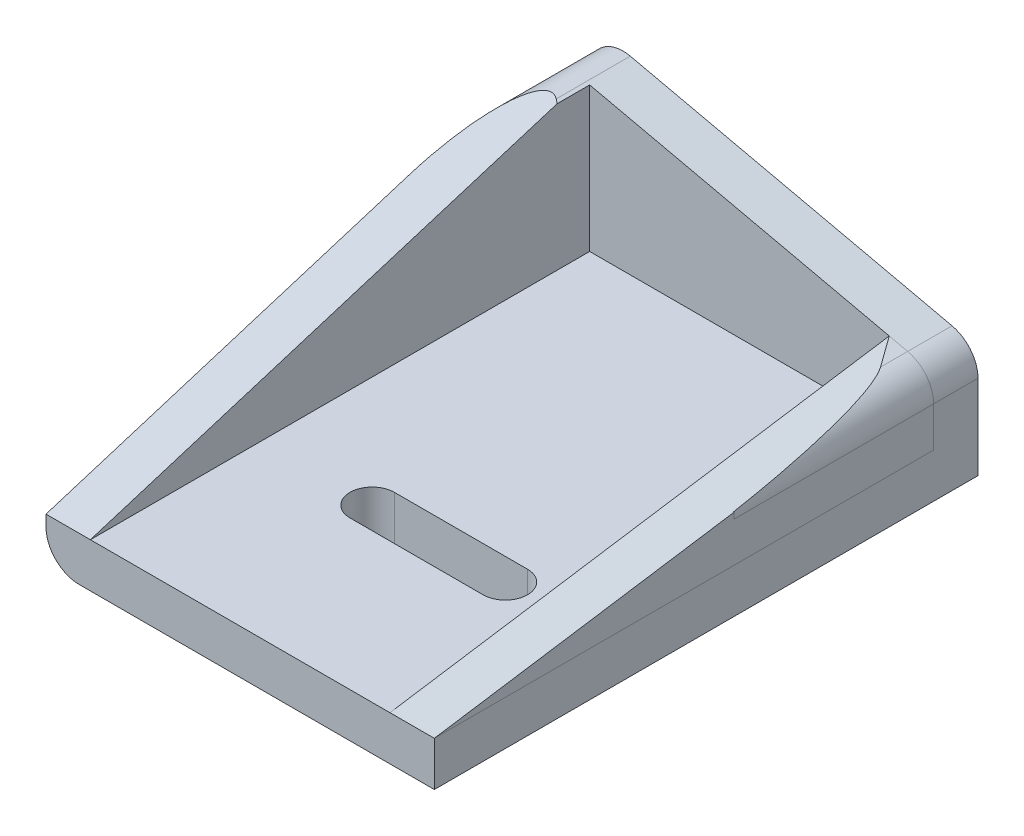
ISO-10303-21;
HEADER;
FILE_DESCRIPTION(('STEP AP214'),'2;1');
FILE_NAME('part.step','',(''),(''),'','','');
FILE_SCHEMA(('AUTOMOTIVE_DESIGN { 1 0 10303 214 1 1 1 1 }'));
ENDSEC;
DATA;
#1=APPLICATION_CONTEXT('core data for automotive mechanical design processes');
#2=APPLICATION_PROTOCOL_DEFINITION('international standard','automotive_design',2000,#1);
#3=PRODUCT_CONTEXT('',#1,'mechanical');
#4=PRODUCT('Part','Part','',(#3));
#5=PRODUCT_RELATED_PRODUCT_CATEGORY('part','',(#4));
#6=PRODUCT_DEFINITION_FORMATION('','',#4);
#7=PRODUCT_DEFINITION_CONTEXT('part definition',#1,'design');
#8=PRODUCT_DEFINITION('design','',#6,#7);
#9=PRODUCT_DEFINITION_SHAPE('','',#8);
#10=(LENGTH_UNIT() NAMED_UNIT(*) SI_UNIT(.MILLI.,.METRE.));
#11=(NAMED_UNIT(*) PLANE_ANGLE_UNIT() SI_UNIT($,.RADIAN.));
#12=(NAMED_UNIT(*) SI_UNIT($,.STERADIAN.) SOLID_ANGLE_UNIT());
#13=UNCERTAINTY_MEASURE_WITH_UNIT(LENGTH_MEASURE(1.E-05),#10,'distance_accuracy_value','');
#14=(GEOMETRIC_REPRESENTATION_CONTEXT(3) GLOBAL_UNCERTAINTY_ASSIGNED_CONTEXT((#13)) GLOBAL_UNIT_ASSIGNED_CONTEXT((#10,
#11,#12)) REPRESENTATION_CONTEXT('',''));
#15=CARTESIAN_POINT('',(0.,0.,0.));
#16=DIRECTION('',(0.,0.,1.));
#17=DIRECTION('',(1.,0.,0.));
#18=AXIS2_PLACEMENT_3D('',#15,#16,#17);
#19=CARTESIAN_POINT('',(-120.,4.,4.));
#20=DIRECTION('',(0.,0.,1.));
#21=DIRECTION('',(1.,0.,0.));
#22=AXIS2_PLACEMENT_3D('',#19,#20,#21);
#23=PLANE('',#22);
#24=CARTESIAN_POINT('',(-123.,7.60188737121212,4.));
#25=DIRECTION('',(0.,0.,-1.));
#26=DIRECTION('',(-1.,0.,0.));
#27=AXIS2_PLACEMENT_3D('',#24,#25,#26);
#28=CIRCLE('',#27,3.);
#29=CARTESIAN_POINT('',(-122.339217385696,10.5282103774152,4.));
#30=VERTEX_POINT('',#29);
#31=CARTESIAN_POINT('',(-120.,7.60188737121212,4.));
#32=VERTEX_POINT('',#31);
#33=EDGE_CURVE('E122',#30,#32,#28,.T.);
#34=ORIENTED_EDGE('',*,*,#33,.T.);
#35=DIRECTION('',(0.,1.,0.));
#36=VECTOR('',#35,1.);
#37=CARTESIAN_POINT('',(-120.,4.,4.));
#38=LINE('',#37,#36);
#39=CARTESIAN_POINT('',(-120.,4.,4.));
#40=VERTEX_POINT('',#39);
#41=EDGE_CURVE('E87',#40,#32,#38,.T.);
#42=ORIENTED_EDGE('',*,*,#41,.F.);
#43=DIRECTION('',(-1.,0.,0.));
#44=VECTOR('',#43,1.);
#45=CARTESIAN_POINT('',(-120.,4.,4.));
#46=LINE('',#45,#44);
#47=CARTESIAN_POINT('',(-124.,4.,4.));
#48=VERTEX_POINT('',#47);
#49=EDGE_CURVE('E81',#40,#48,#46,.T.);
#50=ORIENTED_EDGE('',*,*,#49,.T.);
#51=DIRECTION('',(0.,1.,0.));
#52=VECTOR('',#51,1.);
#53=CARTESIAN_POINT('',(-124.,4.,4.));
#54=LINE('',#53,#52);
#55=CARTESIAN_POINT('',(-124.,10.9032258064516,4.));
#56=VERTEX_POINT('',#55);
#57=EDGE_CURVE('E95',#48,#56,#54,.T.);
#58=ORIENTED_EDGE('',*,*,#57,.T.);
#59=DIRECTION('',(-0.975441002067707,0.220260871434643,0.));
#60=VECTOR('',#59,1.);
#61=CARTESIAN_POINT('',(-3.67326732673265,-16.2673267326732,4.));
#62=LINE('',#61,#60);
#63=EDGE_CURVE('E119',#30,#56,#62,.T.);
#64=ORIENTED_EDGE('',*,*,#63,.F.);
#65=EDGE_LOOP('',(#34,#42,#50,#58,#64));
#66=FACE_BOUND('',#65,.T.);
#67=ADVANCED_FACE('F43',(#66),#23,.F.);
#68=CARTESIAN_POINT('',(-120.,0.,0.));
#69=DIRECTION('',(-1.,0.,0.));
#70=DIRECTION('',(0.,0.,1.));
#71=AXIS2_PLACEMENT_3D('',#68,#69,#70);
#72=PLANE('',#71);
#73=DIRECTION('',(0.,0.,-1.));
#74=VECTOR('',#73,1.);
#75=CARTESIAN_POINT('',(-120.,7.60188737121212,22.));
#76=LINE('',#75,#74);
#77=CARTESIAN_POINT('',(-120.,7.60188737121212,22.));
#78=VERTEX_POINT('',#77);
#79=EDGE_CURVE('E112',#78,#32,#76,.T.);
#80=ORIENTED_EDGE('',*,*,#79,.F.);
#81=DIRECTION('',(0.,-1.,0.));
#82=VECTOR('',#81,1.);
#83=CARTESIAN_POINT('',(-120.,0.,22.));
#84=LINE('',#83,#82);
#85=CARTESIAN_POINT('',(-120.,8.14193548387097,22.));
#86=VERTEX_POINT('',#85);
#87=EDGE_CURVE('E12',#86,#78,#84,.T.);
#88=ORIENTED_EDGE('',*,*,#87,.F.);
#89=DIRECTION('',(0.,-0.151631216739419,0.988437137156493));
#90=VECTOR('',#89,1.);
#91=CARTESIAN_POINT('',(-120.,10.9032258064516,4.));
#92=LINE('',#91,#90);
#93=CARTESIAN_POINT('',(-120.,4.,49.));
#94=VERTEX_POINT('',#93);
#95=EDGE_CURVE('E105',#86,#94,#92,.T.);
#96=ORIENTED_EDGE('',*,*,#95,.T.);
#97=DIRECTION('',(0.,0.,-1.));
#98=VECTOR('',#97,1.);
#99=CARTESIAN_POINT('',(-120.,4.,49.));
#100=LINE('',#99,#98);
#101=EDGE_CURVE('E65',#94,#40,#100,.T.);
#102=ORIENTED_EDGE('',*,*,#101,.T.);
#103=ORIENTED_EDGE('',*,*,#41,.T.);
#104=EDGE_LOOP('',(#80,#88,#96,#102,#103));
#105=FACE_BOUND('',#104,.T.);
#106=ADVANCED_FACE('F135',(#105),#72,.F.);
#107=CARTESIAN_POINT('',(-120.,10.9032258064516,4.));
#108=DIRECTION('',(0.,-0.988437137156493,-0.151631216739419));
#109=DIRECTION('',(0.,0.151631216739419,-0.988437137156493));
#110=AXIS2_PLACEMENT_3D('',#107,#108,#109);
#111=PLANE('',#110);
#112=CARTESIAN_POINT('',(-123.,7.60188737121212,25.5204070895284));
#113=DIRECTION('',(0.,-0.988437137156493,-0.151631216739419));
#114=DIRECTION('',(0.,0.151631216739419,-0.988437137156493));
#115=AXIS2_PLACEMENT_3D('',#112,#113,#114);
#116=ELLIPSE('',#115,19.7848442062927,3.);
#117=CARTESIAN_POINT('',(-122.339217385696,10.5282103774152,6.44460992292396));
#118=VERTEX_POINT('',#117);
#119=CARTESIAN_POINT('',(-120.049008973918,8.14193548387097,22.));
#120=VERTEX_POINT('',#119);
#121=EDGE_CURVE('E98',#118,#120,#116,.T.);
#122=ORIENTED_EDGE('',*,*,#121,.F.);
#123=DIRECTION('',(-0.557480595817172,0.125882715184522,-0.82059059664677));
#124=VECTOR('',#123,1.);
#125=CARTESIAN_POINT('',(-122.756861541149,10.622517122195,5.82985333896244));
#126=LINE('',#125,#124);
#127=EDGE_CURVE('E109',#118,#56,#126,.T.);
#128=ORIENTED_EDGE('',*,*,#127,.T.);
#129=DIRECTION('',(0.,-0.151631216739419,0.988437137156493));
#130=VECTOR('',#129,1.);
#131=CARTESIAN_POINT('',(-124.,10.9032258064516,4.));
#132=LINE('',#131,#130);
#133=CARTESIAN_POINT('',(-124.,4.,49.));
#134=VERTEX_POINT('',#133);
#135=EDGE_CURVE('E88',#56,#134,#132,.T.);
#136=ORIENTED_EDGE('',*,*,#135,.T.);
#137=DIRECTION('',(-1.,0.,0.));
#138=VECTOR('',#137,1.);
#139=CARTESIAN_POINT('',(-120.,4.,49.));
#140=LINE('',#139,#138);
#141=EDGE_CURVE('E50',#94,#134,#140,.T.);
#142=ORIENTED_EDGE('',*,*,#141,.F.);
#143=ORIENTED_EDGE('',*,*,#95,.F.);
#144=DIRECTION('',(1.,0.,0.));
#145=VECTOR('',#144,1.);
#146=CARTESIAN_POINT('',(-120.,8.14193548387097,22.));
#147=LINE('',#146,#145);
#148=EDGE_CURVE('E56',#120,#86,#147,.T.);
#149=ORIENTED_EDGE('',*,*,#148,.F.);
#150=EDGE_LOOP('',(#122,#128,#136,#142,#143,#149));
#151=FACE_BOUND('',#150,.T.);
#152=ADVANCED_FACE('F146',(#151),#111,.F.);
#153=CARTESIAN_POINT('',(-120.,4.,49.));
#154=DIRECTION('',(0.,1.,0.));
#155=DIRECTION('',(0.,0.,1.));
#156=AXIS2_PLACEMENT_3D('',#153,#154,#155);
#157=PLANE('',#156);
#158=DIRECTION('',(0.,0.,-1.));
#159=VECTOR('',#158,1.);
#160=CARTESIAN_POINT('',(-124.,4.,49.));
#161=LINE('',#160,#159);
#162=EDGE_CURVE('E78',#134,#48,#161,.T.);
#163=ORIENTED_EDGE('',*,*,#162,.T.);
#164=ORIENTED_EDGE('',*,*,#49,.F.);
#165=ORIENTED_EDGE('',*,*,#101,.F.);
#166=ORIENTED_EDGE('',*,*,#141,.T.);
#167=EDGE_LOOP('',(#163,#164,#165,#166));
#168=FACE_BOUND('',#167,.T.);
#169=ADVANCED_FACE('F80',(#168),#157,.F.);
#170=CARTESIAN_POINT('',(-124.,0.,0.));
#171=DIRECTION('',(-1.,0.,0.));
#172=DIRECTION('',(0.,0.,1.));
#173=AXIS2_PLACEMENT_3D('',#170,#171,#172);
#174=PLANE('',#173);
#175=ORIENTED_EDGE('',*,*,#57,.F.);
#176=ORIENTED_EDGE('',*,*,#162,.F.);
#177=ORIENTED_EDGE('',*,*,#135,.F.);
#178=EDGE_LOOP('',(#175,#176,#177));
#179=FACE_BOUND('',#178,.T.);
#180=ADVANCED_FACE('F97',(#179),#174,.T.);
#181=CARTESIAN_POINT('',(-123.,7.60188737121212,22.));
#182=DIRECTION('',(0.,0.,-1.));
#183=DIRECTION('',(-1.,0.,0.));
#184=AXIS2_PLACEMENT_3D('',#181,#182,#183);
#185=CYLINDRICAL_SURFACE('',#184,3.);
#186=ORIENTED_EDGE('',*,*,#121,.T.);
#187=CARTESIAN_POINT('',(-123.,7.60188737121212,22.));
#188=DIRECTION('',(0.,0.,-1.));
#189=DIRECTION('',(-1.,0.,0.));
#190=AXIS2_PLACEMENT_3D('',#187,#188,#189);
#191=CIRCLE('',#190,3.);
#192=EDGE_CURVE('E116',#120,#78,#191,.T.);
#193=ORIENTED_EDGE('',*,*,#192,.T.);
#194=ORIENTED_EDGE('',*,*,#79,.T.);
#195=ORIENTED_EDGE('',*,*,#33,.F.);
#196=DIRECTION('',(0.,0.,-1.));
#197=VECTOR('',#196,1.);
#198=CARTESIAN_POINT('',(-122.339217385696,10.5282103774152,22.));
#199=LINE('',#198,#197);
#200=EDGE_CURVE('E113',#118,#30,#199,.T.);
#201=ORIENTED_EDGE('',*,*,#200,.F.);
#202=EDGE_LOOP('',(#186,#193,#194,#195,#201));
#203=FACE_BOUND('',#202,.T.);
#204=ADVANCED_FACE('F128',(#203),#185,.T.);
#205=CARTESIAN_POINT('',(0.,0.,22.));
#206=DIRECTION('',(0.,0.,-1.));
#207=DIRECTION('',(-1.,0.,0.));
#208=AXIS2_PLACEMENT_3D('',#205,#206,#207);
#209=PLANE('',#208);
#210=ORIENTED_EDGE('',*,*,#148,.T.);
#211=ORIENTED_EDGE('',*,*,#87,.T.);
#212=ORIENTED_EDGE('',*,*,#192,.F.);
#213=EDGE_LOOP('',(#210,#211,#212));
#214=FACE_BOUND('',#213,.T.);
#215=ADVANCED_FACE('F184',(#214),#209,.T.);
#216=CARTESIAN_POINT('',(-3.67326732673265,-16.2673267326732,22.));
#217=DIRECTION('',(-0.220260871434643,-0.975441002067707,0.));
#218=DIRECTION('',(0.975441002067707,-0.220260871434643,0.));
#219=AXIS2_PLACEMENT_3D('',#216,#217,#218);
#220=PLANE('',#219);
#221=ORIENTED_EDGE('',*,*,#200,.T.);
#222=ORIENTED_EDGE('',*,*,#63,.T.);
#223=ORIENTED_EDGE('',*,*,#127,.F.);
#224=EDGE_LOOP('',(#221,#222,#223));
#225=FACE_BOUND('',#224,.T.);
#226=ADVANCED_FACE('F144',(#225),#220,.F.);
#227=CLOSED_SHELL('',(#67,#106,#152,#169,#180,#204,#215,#226));
#228=MANIFOLD_SOLID_BREP('B2',#227);
#229=CARTESIAN_POINT('',(-155.,3.,4.));
#230=DIRECTION('',(1.,0.,0.));
#231=DIRECTION('',(0.,0.,-1.));
#232=AXIS2_PLACEMENT_3D('',#229,#230,#231);
#233=PLANE('',#232);
#234=DIRECTION('',(0.,0.295192600716355,-0.955437767979849));
#235=VECTOR('',#234,1.);
#236=CARTESIAN_POINT('',(-155.,4.,49.));
#237=LINE('',#236,#235);
#238=CARTESIAN_POINT('',(-155.,4.,49.));
#239=VERTEX_POINT('',#238);
#240=CARTESIAN_POINT('',(-155.,14.1502744679863,16.147023473687));
#241=VERTEX_POINT('',#240);
#242=EDGE_CURVE('E376',#239,#241,#237,.T.);
#243=ORIENTED_EDGE('',*,*,#242,.T.);
#244=DIRECTION('',(0.,0.,-1.));
#245=VECTOR('',#244,1.);
#246=CARTESIAN_POINT('',(-155.,14.1502744679863,4.));
#247=LINE('',#246,#245);
#248=CARTESIAN_POINT('',(-155.,14.1502744679863,0.));
#249=VERTEX_POINT('',#248);
#250=EDGE_CURVE('E430',#241,#249,#247,.T.);
#251=ORIENTED_EDGE('',*,*,#250,.T.);
#252=DIRECTION('',(0.,-1.,0.));
#253=VECTOR('',#252,1.);
#254=CARTESIAN_POINT('',(-155.,3.,0.));
#255=LINE('',#254,#253);
#256=CARTESIAN_POINT('',(-155.,3.,0.));
#257=VERTEX_POINT('',#256);
#258=EDGE_CURVE('E412',#249,#257,#255,.T.);
#259=ORIENTED_EDGE('',*,*,#258,.T.);
#260=DIRECTION('',(0.,0.,-1.));
#261=VECTOR('',#260,1.);
#262=CARTESIAN_POINT('',(-155.,3.,4.));
#263=LINE('',#262,#261);
#264=CARTESIAN_POINT('',(-155.,3.,49.));
#265=VERTEX_POINT('',#264);
#266=EDGE_CURVE('E428',#257,#265,#263,.F.);
#267=ORIENTED_EDGE('',*,*,#266,.T.);
#268=DIRECTION('',(0.,1.,0.));
#269=VECTOR('',#268,1.);
#270=CARTESIAN_POINT('',(-155.,0.,49.));
#271=LINE('',#270,#269);
#272=EDGE_CURVE('E331',#265,#239,#271,.T.);
#273=ORIENTED_EDGE('',*,*,#272,.T.);
#274=EDGE_LOOP('',(#243,#251,#259,#267,#273));
#275=FACE_BOUND('',#274,.T.);
#276=ADVANCED_FACE('F213',(#275),#233,.F.);
#277=CARTESIAN_POINT('',(0.,0.,4.));
#278=DIRECTION('',(0.,0.,-1.));
#279=DIRECTION('',(-1.,0.,0.));
#280=AXIS2_PLACEMENT_3D('',#277,#278,#279);
#281=PLANE('',#280);
#282=DIRECTION('',(0.,1.,0.));
#283=VECTOR('',#282,1.);
#284=CARTESIAN_POINT('',(-120.,0.,4.));
#285=LINE('',#284,#283);
#286=CARTESIAN_POINT('',(-120.,4.,4.));
#287=VERTEX_POINT('',#286);
#288=CARTESIAN_POINT('',(-120.,7.60188737121212,4.));
#289=VERTEX_POINT('',#288);
#290=EDGE_CURVE('E408',#287,#289,#285,.T.);
#291=ORIENTED_EDGE('',*,*,#290,.T.);
#292=CARTESIAN_POINT('',(-123.,7.60188737121212,4.));
#293=DIRECTION('',(0.,0.,-1.));
#294=DIRECTION('',(-1.,0.,0.));
#295=AXIS2_PLACEMENT_3D('',#292,#293,#294);
#296=CIRCLE('',#295,3.);
#297=CARTESIAN_POINT('',(-122.339217385696,10.5282103774152,4.));
#298=VERTEX_POINT('',#297);
#299=EDGE_CURVE('E356',#289,#298,#296,.F.);
#300=ORIENTED_EDGE('',*,*,#299,.T.);
#301=DIRECTION('',(-0.975441002067707,0.220260871434643,0.));
#302=VECTOR('',#301,1.);
#303=CARTESIAN_POINT('',(-155.,17.9032258064516,4.));
#304=LINE('',#303,#302);
#305=CARTESIAN_POINT('',(-151.,17.,4.));
#306=VERTEX_POINT('',#305);
#307=EDGE_CURVE('E411',#298,#306,#304,.T.);
#308=ORIENTED_EDGE('',*,*,#307,.T.);
#309=DIRECTION('',(0.,-1.,0.));
#310=VECTOR('',#309,1.);
#311=CARTESIAN_POINT('',(-151.,17.9032258064516,4.));
#312=LINE('',#311,#310);
#313=CARTESIAN_POINT('',(-151.,4.,4.));
#314=VERTEX_POINT('',#313);
#315=EDGE_CURVE('E392',#306,#314,#312,.T.);
#316=ORIENTED_EDGE('',*,*,#315,.T.);
#317=DIRECTION('',(-1.,0.,0.));
#318=VECTOR('',#317,1.);
#319=CARTESIAN_POINT('',(-74.8225720076939,4.,4.));
#320=LINE('',#319,#318);
#321=EDGE_CURVE('E400',#287,#314,#320,.T.);
#322=ORIENTED_EDGE('',*,*,#321,.F.);
#323=EDGE_LOOP('',(#291,#300,#308,#316,#322));
#324=FACE_BOUND('',#323,.T.);
#325=ADVANCED_FACE('F464',(#324),#281,.F.);
#326=CARTESIAN_POINT('',(-120.,0.,4.));
#327=DIRECTION('',(0.,1.,0.));
#328=DIRECTION('',(-1.,0.,0.));
#329=AXIS2_PLACEMENT_3D('',#326,#327,#328);
#330=PLANE('',#329);
#331=DIRECTION('',(1.,0.,0.));
#332=VECTOR('',#331,1.);
#333=CARTESIAN_POINT('',(-129.,0.,35.5999999999979));
#334=LINE('',#333,#332);
#335=CARTESIAN_POINT('',(-129.,0.,35.5999999999979));
#336=VERTEX_POINT('',#335);
#337=CARTESIAN_POINT('',(-141.,0.,35.5999999999979));
#338=VERTEX_POINT('',#337);
#339=EDGE_CURVE('E369',#336,#338,#334,.F.);
#340=ORIENTED_EDGE('',*,*,#339,.F.);
#341=CARTESIAN_POINT('',(-129.,0.,33.5999999999979));
#342=DIRECTION('',(0.,-1.,0.));
#343=DIRECTION('',(1.,0.,0.));
#344=AXIS2_PLACEMENT_3D('',#341,#342,#343);
#345=CIRCLE('',#344,2.);
#346=CARTESIAN_POINT('',(-129.,0.,31.5999999999979));
#347=VERTEX_POINT('',#346);
#348=EDGE_CURVE('E217',#347,#336,#345,.T.);
#349=ORIENTED_EDGE('',*,*,#348,.F.);
#350=DIRECTION('',(-1.,0.,0.));
#351=VECTOR('',#350,1.);
#352=CARTESIAN_POINT('',(-129.,0.,31.5999999999979));
#353=LINE('',#352,#351);
#354=CARTESIAN_POINT('',(-141.,0.,31.5999999999979));
#355=VERTEX_POINT('',#354);
#356=EDGE_CURVE('E257',#355,#347,#353,.F.);
#357=ORIENTED_EDGE('',*,*,#356,.F.);
#358=CARTESIAN_POINT('',(-141.,0.,33.5999999999979));
#359=DIRECTION('',(0.,-1.,0.));
#360=DIRECTION('',(1.,0.,0.));
#361=AXIS2_PLACEMENT_3D('',#358,#359,#360);
#362=CIRCLE('',#361,2.);
#363=EDGE_CURVE('E371',#338,#355,#362,.T.);
#364=ORIENTED_EDGE('',*,*,#363,.F.);
#365=EDGE_LOOP('',(#340,#349,#357,#364));
#366=FACE_BOUND('',#365,.T.);
#367=DIRECTION('',(-1.,0.,0.));
#368=VECTOR('',#367,1.);
#369=CARTESIAN_POINT('',(-74.8225720076939,0.,49.));
#370=LINE('',#369,#368);
#371=CARTESIAN_POINT('',(-120.,0.,49.));
#372=VERTEX_POINT('',#371);
#373=CARTESIAN_POINT('',(-152.,0.,49.));
#374=VERTEX_POINT('',#373);
#375=EDGE_CURVE('E329',#372,#374,#370,.T.);
#376=ORIENTED_EDGE('',*,*,#375,.T.);
#377=DIRECTION('',(0.,0.,-1.));
#378=VECTOR('',#377,1.);
#379=CARTESIAN_POINT('',(-152.,0.,4.));
#380=LINE('',#379,#378);
#381=CARTESIAN_POINT('',(-152.,0.,0.));
#382=VERTEX_POINT('',#381);
#383=EDGE_CURVE('E336',#374,#382,#380,.T.);
#384=ORIENTED_EDGE('',*,*,#383,.T.);
#385=DIRECTION('',(1.,0.,0.));
#386=VECTOR('',#385,1.);
#387=CARTESIAN_POINT('',(-120.,0.,0.));
#388=LINE('',#387,#386);
#389=CARTESIAN_POINT('',(-120.,0.,0.));
#390=VERTEX_POINT('',#389);
#391=EDGE_CURVE('E402',#382,#390,#388,.T.);
#392=ORIENTED_EDGE('',*,*,#391,.T.);
#393=DIRECTION('',(0.,0.,-1.));
#394=VECTOR('',#393,1.);
#395=CARTESIAN_POINT('',(-120.,0.,4.));
#396=LINE('',#395,#394);
#397=EDGE_CURVE('E343',#372,#390,#396,.T.);
#398=ORIENTED_EDGE('',*,*,#397,.F.);
#399=EDGE_LOOP('',(#376,#384,#392,#398));
#400=FACE_BOUND('',#399,.T.);
#401=ADVANCED_FACE('F340',(#366,#400),#330,.F.);
#402=CARTESIAN_POINT('',(-120.,0.,4.));
#403=DIRECTION('',(-1.,0.,0.));
#404=DIRECTION('',(0.,0.,1.));
#405=AXIS2_PLACEMENT_3D('',#402,#403,#404);
#406=PLANE('',#405);
#407=DIRECTION('',(0.,1.,0.));
#408=VECTOR('',#407,1.);
#409=CARTESIAN_POINT('',(-120.,0.,0.));
#410=LINE('',#409,#408);
#411=CARTESIAN_POINT('',(-120.,7.60188737121212,0.));
#412=VERTEX_POINT('',#411);
#413=EDGE_CURVE('E417',#390,#412,#410,.T.);
#414=ORIENTED_EDGE('',*,*,#413,.T.);
#415=DIRECTION('',(0.,0.,-1.));
#416=VECTOR('',#415,1.);
#417=CARTESIAN_POINT('',(-120.,7.60188737121212,4.));
#418=LINE('',#417,#416);
#419=EDGE_CURVE('E335',#412,#289,#418,.F.);
#420=ORIENTED_EDGE('',*,*,#419,.T.);
#421=ORIENTED_EDGE('',*,*,#290,.F.);
#422=DIRECTION('',(0.,0.,1.));
#423=VECTOR('',#422,1.);
#424=CARTESIAN_POINT('',(-120.,4.,4.));
#425=LINE('',#424,#423);
#426=CARTESIAN_POINT('',(-120.,4.,49.));
#427=VERTEX_POINT('',#426);
#428=EDGE_CURVE('E399',#287,#427,#425,.T.);
#429=ORIENTED_EDGE('',*,*,#428,.T.);
#430=DIRECTION('',(0.,-1.,0.));
#431=VECTOR('',#430,1.);
#432=CARTESIAN_POINT('',(-120.,0.,49.));
#433=LINE('',#432,#431);
#434=EDGE_CURVE('E397',#427,#372,#433,.T.);
#435=ORIENTED_EDGE('',*,*,#434,.T.);
#436=ORIENTED_EDGE('',*,*,#397,.T.);
#437=EDGE_LOOP('',(#414,#420,#421,#429,#435,#436));
#438=FACE_BOUND('',#437,.T.);
#439=ADVANCED_FACE('F458',(#438),#406,.F.);
#440=CARTESIAN_POINT('',(-155.,17.9032258064516,4.));
#441=DIRECTION('',(-0.220260871434643,-0.975441002067707,0.));
#442=DIRECTION('',(0.975441002067707,-0.220260871434643,0.));
#443=AXIS2_PLACEMENT_3D('',#440,#441,#442);
#444=PLANE('',#443);
#445=DIRECTION('',(-0.975441002067707,0.220260871434643,0.));
#446=VECTOR('',#445,1.);
#447=CARTESIAN_POINT('',(-155.,17.9032258064516,0.));
#448=LINE('',#447,#446);
#449=CARTESIAN_POINT('',(-122.339217385696,10.5282103774152,0.));
#450=VERTEX_POINT('',#449);
#451=CARTESIAN_POINT('',(-151.339217385696,17.0765974741894,0.));
#452=VERTEX_POINT('',#451);
#453=EDGE_CURVE('E420',#450,#452,#448,.T.);
#454=ORIENTED_EDGE('',*,*,#453,.T.);
#455=DIRECTION('',(0.,0.,-1.));
#456=VECTOR('',#455,1.);
#457=CARTESIAN_POINT('',(-151.339217385696,17.0765974741894,4.));
#458=LINE('',#457,#456);
#459=CARTESIAN_POINT('',(-151.339217385696,17.0765974741894,6.67551397565136));
#460=VERTEX_POINT('',#459);
#461=EDGE_CURVE('E349',#452,#460,#458,.F.);
#462=ORIENTED_EDGE('',*,*,#461,.T.);
#463=DIRECTION('',(0.794265728426367,-0.179350325773701,0.580495834000727));
#464=VECTOR('',#463,1.);
#465=CARTESIAN_POINT('',(-129.747970440447,12.2011546155847,22.4556596548941));
#466=LINE('',#465,#464);
#467=CARTESIAN_POINT('',(-151.,17.,6.92343387470999));
#468=VERTEX_POINT('',#467);
#469=EDGE_CURVE('E373',#460,#468,#466,.T.);
#470=ORIENTED_EDGE('',*,*,#469,.T.);
#471=DIRECTION('',(0.,0.,-1.));
#472=VECTOR('',#471,1.);
#473=CARTESIAN_POINT('',(-151.,17.,0.));
#474=LINE('',#473,#472);
#475=EDGE_CURVE('E358',#468,#306,#474,.T.);
#476=ORIENTED_EDGE('',*,*,#475,.T.);
#477=ORIENTED_EDGE('',*,*,#307,.F.);
#478=DIRECTION('',(0.,0.,-1.));
#479=VECTOR('',#478,1.);
#480=CARTESIAN_POINT('',(-122.339217385696,10.5282103774152,4.));
#481=LINE('',#480,#479);
#482=EDGE_CURVE('E415',#298,#450,#481,.T.);
#483=ORIENTED_EDGE('',*,*,#482,.T.);
#484=EDGE_LOOP('',(#454,#462,#470,#476,#477,#483));
#485=FACE_BOUND('',#484,.T.);
#486=ADVANCED_FACE('F441',(#485),#444,.F.);
#487=CARTESIAN_POINT('',(0.,0.,0.));
#488=DIRECTION('',(0.,0.,-1.));
#489=DIRECTION('',(-1.,0.,0.));
#490=AXIS2_PLACEMENT_3D('',#487,#488,#489);
#491=PLANE('',#490);
#492=ORIENTED_EDGE('',*,*,#258,.F.);
#493=CARTESIAN_POINT('',(-152.,14.1502744679863,0.));
#494=DIRECTION('',(0.,0.,-1.));
#495=DIRECTION('',(-1.,0.,0.));
#496=AXIS2_PLACEMENT_3D('',#493,#494,#495);
#497=CIRCLE('',#496,3.);
#498=EDGE_CURVE('E351',#249,#452,#497,.T.);
#499=ORIENTED_EDGE('',*,*,#498,.T.);
#500=ORIENTED_EDGE('',*,*,#453,.F.);
#501=CARTESIAN_POINT('',(-123.,7.60188737121212,0.));
#502=DIRECTION('',(0.,0.,-1.));
#503=DIRECTION('',(-1.,0.,0.));
#504=AXIS2_PLACEMENT_3D('',#501,#502,#503);
#505=CIRCLE('',#504,3.);
#506=EDGE_CURVE('E433',#450,#412,#505,.T.);
#507=ORIENTED_EDGE('',*,*,#506,.T.);
#508=ORIENTED_EDGE('',*,*,#413,.F.);
#509=ORIENTED_EDGE('',*,*,#391,.F.);
#510=CARTESIAN_POINT('',(-152.,3.,0.));
#511=DIRECTION('',(0.,0.,-1.));
#512=DIRECTION('',(-1.,0.,0.));
#513=AXIS2_PLACEMENT_3D('',#510,#511,#512);
#514=CIRCLE('',#513,3.);
#515=EDGE_CURVE('E348',#382,#257,#514,.T.);
#516=ORIENTED_EDGE('',*,*,#515,.T.);
#517=EDGE_LOOP('',(#492,#499,#500,#507,#508,#509,#516));
#518=FACE_BOUND('',#517,.T.);
#519=ADVANCED_FACE('F438',(#518),#491,.T.);
#520=CARTESIAN_POINT('',(-74.8225720076939,4.,4.));
#521=DIRECTION('',(0.,1.,0.));
#522=DIRECTION('',(0.,0.,1.));
#523=AXIS2_PLACEMENT_3D('',#520,#521,#522);
#524=PLANE('',#523);
#525=CARTESIAN_POINT('',(-129.,4.,33.5999999999979));
#526=DIRECTION('',(0.,1.,0.));
#527=DIRECTION('',(0.,0.,1.));
#528=AXIS2_PLACEMENT_3D('',#525,#526,#527);
#529=CIRCLE('',#528,2.);
#530=CARTESIAN_POINT('',(-129.,4.,35.5999999999979));
#531=VERTEX_POINT('',#530);
#532=CARTESIAN_POINT('',(-129.,4.,31.5999999999979));
#533=VERTEX_POINT('',#532);
#534=EDGE_CURVE('E41',#531,#533,#529,.T.);
#535=ORIENTED_EDGE('',*,*,#534,.F.);
#536=DIRECTION('',(1.,0.,0.));
#537=VECTOR('',#536,1.);
#538=CARTESIAN_POINT('',(-74.8225720076939,4.,35.5999999999979));
#539=LINE('',#538,#537);
#540=CARTESIAN_POINT('',(-141.,4.,35.5999999999979));
#541=VERTEX_POINT('',#540);
#542=EDGE_CURVE('E363',#541,#531,#539,.T.);
#543=ORIENTED_EDGE('',*,*,#542,.F.);
#544=CARTESIAN_POINT('',(-141.,4.,33.5999999999979));
#545=DIRECTION('',(0.,1.,0.));
#546=DIRECTION('',(0.,0.,1.));
#547=AXIS2_PLACEMENT_3D('',#544,#545,#546);
#548=CIRCLE('',#547,2.);
#549=CARTESIAN_POINT('',(-141.,4.,31.5999999999979));
#550=VERTEX_POINT('',#549);
#551=EDGE_CURVE('E365',#550,#541,#548,.T.);
#552=ORIENTED_EDGE('',*,*,#551,.F.);
#553=DIRECTION('',(-1.,0.,0.));
#554=VECTOR('',#553,1.);
#555=CARTESIAN_POINT('',(-74.8225720076939,4.,31.5999999999979));
#556=LINE('',#555,#554);
#557=EDGE_CURVE('E222',#533,#550,#556,.T.);
#558=ORIENTED_EDGE('',*,*,#557,.F.);
#559=EDGE_LOOP('',(#535,#543,#552,#558));
#560=FACE_BOUND('',#559,.T.);
#561=DIRECTION('',(0.,0.,1.));
#562=VECTOR('',#561,1.);
#563=CARTESIAN_POINT('',(-151.,4.,4.));
#564=LINE('',#563,#562);
#565=CARTESIAN_POINT('',(-151.,4.,49.));
#566=VERTEX_POINT('',#565);
#567=EDGE_CURVE('E382',#314,#566,#564,.T.);
#568=ORIENTED_EDGE('',*,*,#567,.T.);
#569=DIRECTION('',(-1.,0.,0.));
#570=VECTOR('',#569,1.);
#571=CARTESIAN_POINT('',(-74.8225720076939,4.,49.));
#572=LINE('',#571,#570);
#573=EDGE_CURVE('E345',#427,#566,#572,.T.);
#574=ORIENTED_EDGE('',*,*,#573,.F.);
#575=ORIENTED_EDGE('',*,*,#428,.F.);
#576=ORIENTED_EDGE('',*,*,#321,.T.);
#577=EDGE_LOOP('',(#568,#574,#575,#576));
#578=FACE_BOUND('',#577,.T.);
#579=ADVANCED_FACE('F455',(#560,#578),#524,.T.);
#580=CARTESIAN_POINT('',(-74.8225720076939,0.,49.));
#581=DIRECTION('',(0.,0.,1.));
#582=DIRECTION('',(1.,0.,0.));
#583=AXIS2_PLACEMENT_3D('',#580,#581,#582);
#584=PLANE('',#583);
#585=ORIENTED_EDGE('',*,*,#272,.F.);
#586=CARTESIAN_POINT('',(-152.,3.,49.));
#587=DIRECTION('',(0.,0.,1.));
#588=DIRECTION('',(1.,0.,0.));
#589=AXIS2_PLACEMENT_3D('',#586,#587,#588);
#590=CIRCLE('',#589,3.);
#591=EDGE_CURVE('E325',#265,#374,#590,.T.);
#592=ORIENTED_EDGE('',*,*,#591,.T.);
#593=ORIENTED_EDGE('',*,*,#375,.F.);
#594=ORIENTED_EDGE('',*,*,#434,.F.);
#595=ORIENTED_EDGE('',*,*,#573,.T.);
#596=DIRECTION('',(-1.,0.,0.));
#597=VECTOR('',#596,1.);
#598=CARTESIAN_POINT('',(-151.,4.,49.));
#599=LINE('',#598,#597);
#600=EDGE_CURVE('E394',#566,#239,#599,.T.);
#601=ORIENTED_EDGE('',*,*,#600,.T.);
#602=EDGE_LOOP('',(#585,#592,#593,#594,#595,#601));
#603=FACE_BOUND('',#602,.T.);
#604=ADVANCED_FACE('F327',(#603),#584,.T.);
#605=CARTESIAN_POINT('',(-151.,4.,49.));
#606=DIRECTION('',(0.,0.955437767979848,0.295192600716355));
#607=DIRECTION('',(0.,-0.295192600716355,0.955437767979849));
#608=AXIS2_PLACEMENT_3D('',#605,#606,#607);
#609=PLANE('',#608);
#610=CARTESIAN_POINT('',(-152.,14.1502744679863,16.147023473687));
#611=DIRECTION('',(0.,0.955437767979848,0.295192600716355));
#612=DIRECTION('',(0.,0.295192600716355,-0.955437767979849));
#613=AXIS2_PLACEMENT_3D('',#610,#611,#612);
#614=ELLIPSE('',#613,10.1628563613038,3.);
#615=EDGE_CURVE('E360',#241,#460,#614,.F.);
#616=ORIENTED_EDGE('',*,*,#615,.F.);
#617=ORIENTED_EDGE('',*,*,#242,.F.);
#618=ORIENTED_EDGE('',*,*,#600,.F.);
#619=DIRECTION('',(0.,0.295192600716355,-0.955437767979849));
#620=VECTOR('',#619,1.);
#621=CARTESIAN_POINT('',(-151.,4.,49.));
#622=LINE('',#621,#620);
#623=EDGE_CURVE('E389',#566,#468,#622,.T.);
#624=ORIENTED_EDGE('',*,*,#623,.T.);
#625=ORIENTED_EDGE('',*,*,#469,.F.);
#626=EDGE_LOOP('',(#616,#617,#618,#624,#625));
#627=FACE_BOUND('',#626,.T.);
#628=ADVANCED_FACE('F448',(#627),#609,.T.);
#629=CARTESIAN_POINT('',(-151.,0.,0.));
#630=DIRECTION('',(1.,0.,0.));
#631=DIRECTION('',(0.,0.,-1.));
#632=AXIS2_PLACEMENT_3D('',#629,#630,#631);
#633=PLANE('',#632);
#634=ORIENTED_EDGE('',*,*,#475,.F.);
#635=ORIENTED_EDGE('',*,*,#623,.F.);
#636=ORIENTED_EDGE('',*,*,#567,.F.);
#637=ORIENTED_EDGE('',*,*,#315,.F.);
#638=EDGE_LOOP('',(#634,#635,#636,#637));
#639=FACE_BOUND('',#638,.T.);
#640=ADVANCED_FACE('F451',(#639),#633,.T.);
#641=CARTESIAN_POINT('',(-152.,14.1502744679863,4.));
#642=DIRECTION('',(0.,0.,-1.));
#643=DIRECTION('',(-1.,0.,0.));
#644=AXIS2_PLACEMENT_3D('',#641,#642,#643);
#645=CYLINDRICAL_SURFACE('',#644,3.);
#646=ORIENTED_EDGE('',*,*,#250,.F.);
#647=ORIENTED_EDGE('',*,*,#615,.T.);
#648=ORIENTED_EDGE('',*,*,#461,.F.);
#649=ORIENTED_EDGE('',*,*,#498,.F.);
#650=EDGE_LOOP('',(#646,#647,#648,#649));
#651=FACE_BOUND('',#650,.T.);
#652=ADVANCED_FACE('F444',(#651),#645,.T.);
#653=CARTESIAN_POINT('',(-152.,3.,4.));
#654=DIRECTION('',(0.,0.,-1.));
#655=DIRECTION('',(-1.,0.,0.));
#656=AXIS2_PLACEMENT_3D('',#653,#654,#655);
#657=CYLINDRICAL_SURFACE('',#656,3.);
#658=ORIENTED_EDGE('',*,*,#591,.F.);
#659=ORIENTED_EDGE('',*,*,#266,.F.);
#660=ORIENTED_EDGE('',*,*,#515,.F.);
#661=ORIENTED_EDGE('',*,*,#383,.F.);
#662=EDGE_LOOP('',(#658,#659,#660,#661));
#663=FACE_BOUND('',#662,.T.);
#664=ADVANCED_FACE('F347',(#663),#657,.T.);
#665=CARTESIAN_POINT('',(-123.,7.60188737121212,4.));
#666=DIRECTION('',(0.,0.,-1.));
#667=DIRECTION('',(-1.,0.,0.));
#668=AXIS2_PLACEMENT_3D('',#665,#666,#667);
#669=CYLINDRICAL_SURFACE('',#668,3.);
#670=ORIENTED_EDGE('',*,*,#299,.F.);
#671=ORIENTED_EDGE('',*,*,#419,.F.);
#672=ORIENTED_EDGE('',*,*,#506,.F.);
#673=ORIENTED_EDGE('',*,*,#482,.F.);
#674=EDGE_LOOP('',(#670,#671,#672,#673));
#675=FACE_BOUND('',#674,.T.);
#676=ADVANCED_FACE('F215',(#675),#669,.T.);
#677=CARTESIAN_POINT('',(-129.,17.1502744679863,33.5999999999979));
#678=DIRECTION('',(0.,-1.,0.));
#679=DIRECTION('',(1.,0.,0.));
#680=AXIS2_PLACEMENT_3D('',#677,#678,#679);
#681=CYLINDRICAL_SURFACE('',#680,2.);
#682=DIRECTION('',(0.,-1.,0.));
#683=VECTOR('',#682,1.);
#684=CARTESIAN_POINT('',(-129.,17.1502744679863,35.5999999999979));
#685=LINE('',#684,#683);
#686=EDGE_CURVE('E230',#531,#336,#685,.T.);
#687=ORIENTED_EDGE('',*,*,#686,.F.);
#688=ORIENTED_EDGE('',*,*,#534,.T.);
#689=DIRECTION('',(0.,-1.,0.));
#690=VECTOR('',#689,1.);
#691=CARTESIAN_POINT('',(-129.,17.1502744679863,31.5999999999979));
#692=LINE('',#691,#690);
#693=EDGE_CURVE('E372',#533,#347,#692,.T.);
#694=ORIENTED_EDGE('',*,*,#693,.T.);
#695=ORIENTED_EDGE('',*,*,#348,.T.);
#696=EDGE_LOOP('',(#687,#688,#694,#695));
#697=FACE_BOUND('',#696,.T.);
#698=ADVANCED_FACE('F487',(#697),#681,.F.);
#699=CARTESIAN_POINT('',(-129.,17.1502744679863,31.5999999999979));
#700=DIRECTION('',(0.,0.,-1.));
#701=DIRECTION('',(-1.,0.,0.));
#702=AXIS2_PLACEMENT_3D('',#699,#700,#701);
#703=PLANE('',#702);
#704=ORIENTED_EDGE('',*,*,#693,.F.);
#705=ORIENTED_EDGE('',*,*,#557,.T.);
#706=DIRECTION('',(0.,-1.,0.));
#707=VECTOR('',#706,1.);
#708=CARTESIAN_POINT('',(-141.,17.1502744679863,31.5999999999979));
#709=LINE('',#708,#707);
#710=EDGE_CURVE('E574',#550,#355,#709,.T.);
#711=ORIENTED_EDGE('',*,*,#710,.T.);
#712=ORIENTED_EDGE('',*,*,#356,.T.);
#713=EDGE_LOOP('',(#704,#705,#711,#712));
#714=FACE_BOUND('',#713,.T.);
#715=ADVANCED_FACE('F491',(#714),#703,.F.);
#716=CARTESIAN_POINT('',(-141.,17.1502744679863,33.5999999999979));
#717=DIRECTION('',(0.,-1.,0.));
#718=DIRECTION('',(1.,0.,0.));
#719=AXIS2_PLACEMENT_3D('',#716,#717,#718);
#720=CYLINDRICAL_SURFACE('',#719,2.);
#721=ORIENTED_EDGE('',*,*,#710,.F.);
#722=ORIENTED_EDGE('',*,*,#551,.T.);
#723=DIRECTION('',(0.,-1.,0.));
#724=VECTOR('',#723,1.);
#725=CARTESIAN_POINT('',(-141.,17.1502744679863,35.5999999999979));
#726=LINE('',#725,#724);
#727=EDGE_CURVE('E236',#541,#338,#726,.T.);
#728=ORIENTED_EDGE('',*,*,#727,.T.);
#729=ORIENTED_EDGE('',*,*,#363,.T.);
#730=EDGE_LOOP('',(#721,#722,#728,#729));
#731=FACE_BOUND('',#730,.T.);
#732=ADVANCED_FACE('F496',(#731),#720,.F.);
#733=CARTESIAN_POINT('',(-129.,17.1502744679863,35.5999999999979));
#734=DIRECTION('',(0.,0.,1.));
#735=DIRECTION('',(1.,0.,0.));
#736=AXIS2_PLACEMENT_3D('',#733,#734,#735);
#737=PLANE('',#736);
#738=ORIENTED_EDGE('',*,*,#727,.F.);
#739=ORIENTED_EDGE('',*,*,#542,.T.);
#740=ORIENTED_EDGE('',*,*,#686,.T.);
#741=ORIENTED_EDGE('',*,*,#339,.T.);
#742=EDGE_LOOP('',(#738,#739,#740,#741));
#743=FACE_BOUND('',#742,.T.);
#744=ADVANCED_FACE('F500',(#743),#737,.F.);
#745=CLOSED_SHELL('',(#276,#325,#401,#439,#486,#519,#579,#604,#628,#640,#652,#664,#676,#698,
#715,#732,#744));
#746=MANIFOLD_SOLID_BREP('B6',#745);
#747=ADVANCED_BREP_SHAPE_REPRESENTATION('',(#18,#228,#746),#14);
#748=SHAPE_DEFINITION_REPRESENTATION(#9,#747);
ENDSEC;
END-ISO-10303-21;
